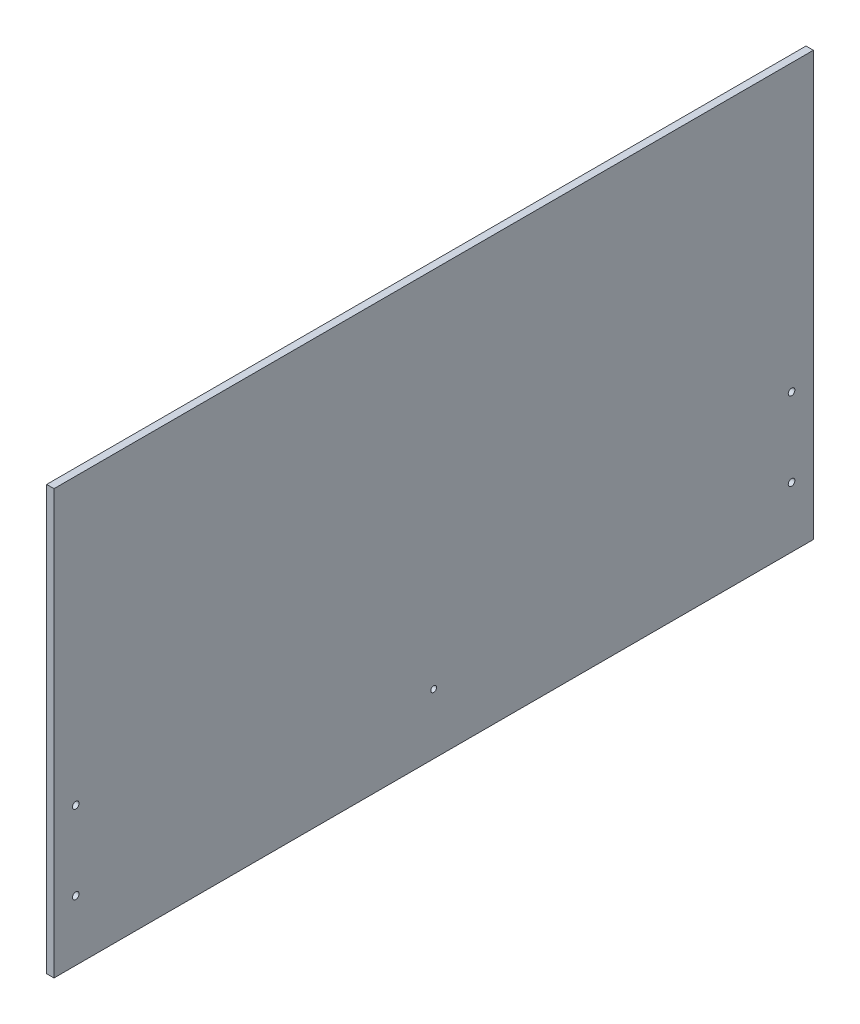
ISO-10303-21;
HEADER;
FILE_DESCRIPTION(('STEP AP214'),'2;1');
FILE_NAME('part.step','',(''),(''),'','','');
FILE_SCHEMA(('AUTOMOTIVE_DESIGN { 1 0 10303 214 1 1 1 1 }'));
ENDSEC;
DATA;
#1=APPLICATION_CONTEXT('core data for automotive mechanical design processes');
#2=APPLICATION_PROTOCOL_DEFINITION('international standard','automotive_design',2000,#1);
#3=PRODUCT_CONTEXT('',#1,'mechanical');
#4=PRODUCT('Part','Part','',(#3));
#5=PRODUCT_RELATED_PRODUCT_CATEGORY('part','',(#4));
#6=PRODUCT_DEFINITION_FORMATION('','',#4);
#7=PRODUCT_DEFINITION_CONTEXT('part definition',#1,'design');
#8=PRODUCT_DEFINITION('design','',#6,#7);
#9=PRODUCT_DEFINITION_SHAPE('','',#8);
#10=(LENGTH_UNIT() NAMED_UNIT(*) SI_UNIT(.MILLI.,.METRE.));
#11=(NAMED_UNIT(*) PLANE_ANGLE_UNIT() SI_UNIT($,.RADIAN.));
#12=(NAMED_UNIT(*) SI_UNIT($,.STERADIAN.) SOLID_ANGLE_UNIT());
#13=UNCERTAINTY_MEASURE_WITH_UNIT(LENGTH_MEASURE(1.E-05),#10,'distance_accuracy_value','');
#14=(GEOMETRIC_REPRESENTATION_CONTEXT(3) GLOBAL_UNCERTAINTY_ASSIGNED_CONTEXT((#13)) GLOBAL_UNIT_ASSIGNED_CONTEXT((#10,
#11,#12)) REPRESENTATION_CONTEXT('',''));
#15=CARTESIAN_POINT('',(0.,0.,0.));
#16=DIRECTION('',(0.,0.,1.));
#17=DIRECTION('',(1.,0.,0.));
#18=AXIS2_PLACEMENT_3D('',#15,#16,#17);
#19=CARTESIAN_POINT('',(4.7625,-137.31875,-246.0625));
#20=DIRECTION('',(0.,0.,1.));
#21=DIRECTION('',(1.,0.,0.));
#22=AXIS2_PLACEMENT_3D('',#19,#20,#21);
#23=PLANE('',#22);
#24=DIRECTION('',(0.,1.,0.));
#25=VECTOR('',#24,1.);
#26=CARTESIAN_POINT('',(0.,-137.31875,-246.0625));
#27=LINE('',#26,#25);
#28=CARTESIAN_POINT('',(0.,-137.31875,-246.0625));
#29=VERTEX_POINT('',#28);
#30=CARTESIAN_POINT('',(0.,137.31875,-246.0625));
#31=VERTEX_POINT('',#30);
#32=EDGE_CURVE('E99',#29,#31,#27,.T.);
#33=ORIENTED_EDGE('',*,*,#32,.T.);
#34=DIRECTION('',(-1.,0.,0.));
#35=VECTOR('',#34,1.);
#36=CARTESIAN_POINT('',(4.7625,137.31875,-246.0625));
#37=LINE('',#36,#35);
#38=CARTESIAN_POINT('',(4.7625,137.31875,-246.0625));
#39=VERTEX_POINT('',#38);
#40=EDGE_CURVE('E11',#39,#31,#37,.T.);
#41=ORIENTED_EDGE('',*,*,#40,.F.);
#42=DIRECTION('',(0.,1.,0.));
#43=VECTOR('',#42,1.);
#44=CARTESIAN_POINT('',(4.7625,-137.31875,-246.0625));
#45=LINE('',#44,#43);
#46=CARTESIAN_POINT('',(4.7625,-137.31875,-246.0625));
#47=VERTEX_POINT('',#46);
#48=EDGE_CURVE('E86',#47,#39,#45,.T.);
#49=ORIENTED_EDGE('',*,*,#48,.F.);
#50=DIRECTION('',(-1.,0.,0.));
#51=VECTOR('',#50,1.);
#52=CARTESIAN_POINT('',(4.7625,-137.31875,-246.0625));
#53=LINE('',#52,#51);
#54=EDGE_CURVE('E95',#47,#29,#53,.T.);
#55=ORIENTED_EDGE('',*,*,#54,.T.);
#56=EDGE_LOOP('',(#33,#41,#49,#55));
#57=FACE_BOUND('',#56,.T.);
#58=ADVANCED_FACE('F33',(#57),#23,.F.);
#59=CARTESIAN_POINT('',(4.7625,137.31875,246.0625));
#60=DIRECTION('',(0.,-1.,0.));
#61=DIRECTION('',(0.,0.,-1.));
#62=AXIS2_PLACEMENT_3D('',#59,#60,#61);
#63=PLANE('',#62);
#64=DIRECTION('',(0.,0.,1.));
#65=VECTOR('',#64,1.);
#66=CARTESIAN_POINT('',(0.,137.31875,246.0625));
#67=LINE('',#66,#65);
#68=CARTESIAN_POINT('',(0.,137.31875,246.0625));
#69=VERTEX_POINT('',#68);
#70=EDGE_CURVE('E90',#31,#69,#67,.T.);
#71=ORIENTED_EDGE('',*,*,#70,.T.);
#72=DIRECTION('',(-1.,0.,0.));
#73=VECTOR('',#72,1.);
#74=CARTESIAN_POINT('',(4.7625,137.31875,246.0625));
#75=LINE('',#74,#73);
#76=CARTESIAN_POINT('',(4.7625,137.31875,246.0625));
#77=VERTEX_POINT('',#76);
#78=EDGE_CURVE('E42',#77,#69,#75,.T.);
#79=ORIENTED_EDGE('',*,*,#78,.F.);
#80=DIRECTION('',(0.,0.,1.));
#81=VECTOR('',#80,1.);
#82=CARTESIAN_POINT('',(4.7625,137.31875,246.0625));
#83=LINE('',#82,#81);
#84=EDGE_CURVE('E81',#39,#77,#83,.T.);
#85=ORIENTED_EDGE('',*,*,#84,.F.);
#86=ORIENTED_EDGE('',*,*,#40,.T.);
#87=EDGE_LOOP('',(#71,#79,#85,#86));
#88=FACE_BOUND('',#87,.T.);
#89=ADVANCED_FACE('F89',(#88),#63,.F.);
#90=CARTESIAN_POINT('',(4.7625,-137.31875,246.0625));
#91=DIRECTION('',(0.,0.,-1.));
#92=DIRECTION('',(-1.,0.,0.));
#93=AXIS2_PLACEMENT_3D('',#90,#91,#92);
#94=PLANE('',#93);
#95=DIRECTION('',(0.,-1.,0.));
#96=VECTOR('',#95,1.);
#97=CARTESIAN_POINT('',(0.,-137.31875,246.0625));
#98=LINE('',#97,#96);
#99=CARTESIAN_POINT('',(0.,-137.31875,246.0625));
#100=VERTEX_POINT('',#99);
#101=EDGE_CURVE('E68',#69,#100,#98,.T.);
#102=ORIENTED_EDGE('',*,*,#101,.T.);
#103=DIRECTION('',(-1.,0.,0.));
#104=VECTOR('',#103,1.);
#105=CARTESIAN_POINT('',(4.7625,-137.31875,246.0625));
#106=LINE('',#105,#104);
#107=CARTESIAN_POINT('',(4.7625,-137.31875,246.0625));
#108=VERTEX_POINT('',#107);
#109=EDGE_CURVE('E91',#108,#100,#106,.T.);
#110=ORIENTED_EDGE('',*,*,#109,.F.);
#111=DIRECTION('',(0.,-1.,0.));
#112=VECTOR('',#111,1.);
#113=CARTESIAN_POINT('',(4.7625,-137.31875,246.0625));
#114=LINE('',#113,#112);
#115=EDGE_CURVE('E84',#77,#108,#114,.T.);
#116=ORIENTED_EDGE('',*,*,#115,.F.);
#117=ORIENTED_EDGE('',*,*,#78,.T.);
#118=EDGE_LOOP('',(#102,#110,#116,#117));
#119=FACE_BOUND('',#118,.T.);
#120=ADVANCED_FACE('F93',(#119),#94,.F.);
#121=CARTESIAN_POINT('',(4.7625,-137.31875,246.0625));
#122=DIRECTION('',(0.,1.,0.));
#123=DIRECTION('',(0.,0.,1.));
#124=AXIS2_PLACEMENT_3D('',#121,#122,#123);
#125=PLANE('',#124);
#126=DIRECTION('',(0.,0.,-1.));
#127=VECTOR('',#126,1.);
#128=CARTESIAN_POINT('',(0.,-137.31875,246.0625));
#129=LINE('',#128,#127);
#130=EDGE_CURVE('E74',#100,#29,#129,.T.);
#131=ORIENTED_EDGE('',*,*,#130,.T.);
#132=ORIENTED_EDGE('',*,*,#54,.F.);
#133=DIRECTION('',(0.,0.,-1.));
#134=VECTOR('',#133,1.);
#135=CARTESIAN_POINT('',(4.7625,-137.31875,246.0625));
#136=LINE('',#135,#134);
#137=EDGE_CURVE('E51',#108,#47,#136,.T.);
#138=ORIENTED_EDGE('',*,*,#137,.F.);
#139=ORIENTED_EDGE('',*,*,#109,.T.);
#140=EDGE_LOOP('',(#131,#132,#138,#139));
#141=FACE_BOUND('',#140,.T.);
#142=ADVANCED_FACE('F143',(#141),#125,.F.);
#143=CARTESIAN_POINT('',(4.7625,0.,0.));
#144=DIRECTION('',(-1.,0.,0.));
#145=DIRECTION('',(0.,0.,1.));
#146=AXIS2_PLACEMENT_3D('',#143,#144,#145);
#147=PLANE('',#146);
#148=CARTESIAN_POINT('',(4.7625,-98.20275,0.));
#149=DIRECTION('',(1.,0.,0.));
#150=DIRECTION('',(0.,0.,-1.));
#151=AXIS2_PLACEMENT_3D('',#148,#149,#150);
#152=CIRCLE('',#151,1.89865);
#153=CARTESIAN_POINT('',(4.7625,-98.20275,-1.89864999999995));
#154=VERTEX_POINT('',#153);
#155=EDGE_CURVE('E233',#154,#154,#152,.T.);
#156=ORIENTED_EDGE('',*,*,#155,.F.);
#157=EDGE_LOOP('',(#156));
#158=FACE_BOUND('',#157,.T.);
#159=CARTESIAN_POINT('',(4.7625,-98.20275,231.93375));
#160=DIRECTION('',(1.,0.,0.));
#161=DIRECTION('',(0.,0.,-1.));
#162=AXIS2_PLACEMENT_3D('',#159,#160,#161);
#163=CIRCLE('',#162,2.15264999999999);
#164=CARTESIAN_POINT('',(4.7625,-98.20275,229.7811));
#165=VERTEX_POINT('',#164);
#166=EDGE_CURVE('E121',#165,#165,#163,.T.);
#167=ORIENTED_EDGE('',*,*,#166,.F.);
#168=EDGE_LOOP('',(#167));
#169=FACE_BOUND('',#168,.T.);
#170=CARTESIAN_POINT('',(4.7625,-47.40275,231.93375));
#171=DIRECTION('',(1.,0.,0.));
#172=DIRECTION('',(0.,0.,-1.));
#173=AXIS2_PLACEMENT_3D('',#170,#171,#172);
#174=CIRCLE('',#173,2.15264999999999);
#175=CARTESIAN_POINT('',(4.7625,-47.40275,229.7811));
#176=VERTEX_POINT('',#175);
#177=EDGE_CURVE('E110',#176,#176,#174,.T.);
#178=ORIENTED_EDGE('',*,*,#177,.F.);
#179=EDGE_LOOP('',(#178));
#180=FACE_BOUND('',#179,.T.);
#181=CARTESIAN_POINT('',(4.7625,-47.40275,-231.93375));
#182=DIRECTION('',(1.,0.,0.));
#183=DIRECTION('',(0.,0.,-1.));
#184=AXIS2_PLACEMENT_3D('',#181,#182,#183);
#185=CIRCLE('',#184,2.15264999999999);
#186=CARTESIAN_POINT('',(4.7625,-47.40275,-234.0864));
#187=VERTEX_POINT('',#186);
#188=EDGE_CURVE('E109',#187,#187,#185,.T.);
#189=ORIENTED_EDGE('',*,*,#188,.F.);
#190=EDGE_LOOP('',(#189));
#191=FACE_BOUND('',#190,.T.);
#192=CARTESIAN_POINT('',(4.7625,-98.20275,-231.93375));
#193=DIRECTION('',(1.,0.,0.));
#194=DIRECTION('',(0.,0.,-1.));
#195=AXIS2_PLACEMENT_3D('',#192,#193,#194);
#196=CIRCLE('',#195,2.15264999999999);
#197=CARTESIAN_POINT('',(4.7625,-98.20275,-234.0864));
#198=VERTEX_POINT('',#197);
#199=EDGE_CURVE('E127',#198,#198,#196,.T.);
#200=ORIENTED_EDGE('',*,*,#199,.F.);
#201=EDGE_LOOP('',(#200));
#202=FACE_BOUND('',#201,.T.);
#203=ORIENTED_EDGE('',*,*,#48,.T.);
#204=ORIENTED_EDGE('',*,*,#84,.T.);
#205=ORIENTED_EDGE('',*,*,#115,.T.);
#206=ORIENTED_EDGE('',*,*,#137,.T.);
#207=EDGE_LOOP('',(#203,#204,#205,#206));
#208=FACE_BOUND('',#207,.T.);
#209=ADVANCED_FACE('F82',(#158,#169,#180,#191,#202,#208),#147,.F.);
#210=CARTESIAN_POINT('',(0.,0.,0.));
#211=DIRECTION('',(-1.,0.,0.));
#212=DIRECTION('',(0.,0.,1.));
#213=AXIS2_PLACEMENT_3D('',#210,#211,#212);
#214=PLANE('',#213);
#215=CARTESIAN_POINT('',(0.,-98.20275,0.));
#216=DIRECTION('',(-1.,0.,0.));
#217=DIRECTION('',(0.,0.,1.));
#218=AXIS2_PLACEMENT_3D('',#215,#216,#217);
#219=CIRCLE('',#218,1.89865);
#220=CARTESIAN_POINT('',(0.,-98.20275,1.89865000000006));
#221=VERTEX_POINT('',#220);
#222=EDGE_CURVE('E230',#221,#221,#219,.T.);
#223=ORIENTED_EDGE('',*,*,#222,.F.);
#224=EDGE_LOOP('',(#223));
#225=FACE_BOUND('',#224,.T.);
#226=CARTESIAN_POINT('',(0.,-98.20275,231.93375));
#227=DIRECTION('',(-1.,0.,0.));
#228=DIRECTION('',(0.,0.,1.));
#229=AXIS2_PLACEMENT_3D('',#226,#227,#228);
#230=CIRCLE('',#229,2.15264999999999);
#231=CARTESIAN_POINT('',(0.,-98.20275,234.0864));
#232=VERTEX_POINT('',#231);
#233=EDGE_CURVE('E36',#232,#232,#230,.T.);
#234=ORIENTED_EDGE('',*,*,#233,.F.);
#235=EDGE_LOOP('',(#234));
#236=FACE_BOUND('',#235,.T.);
#237=CARTESIAN_POINT('',(0.,-47.40275,231.93375));
#238=DIRECTION('',(-1.,0.,0.));
#239=DIRECTION('',(0.,0.,1.));
#240=AXIS2_PLACEMENT_3D('',#237,#238,#239);
#241=CIRCLE('',#240,2.15264999999999);
#242=CARTESIAN_POINT('',(0.,-47.40275,234.0864));
#243=VERTEX_POINT('',#242);
#244=EDGE_CURVE('E107',#243,#243,#241,.T.);
#245=ORIENTED_EDGE('',*,*,#244,.F.);
#246=EDGE_LOOP('',(#245));
#247=FACE_BOUND('',#246,.T.);
#248=CARTESIAN_POINT('',(0.,-47.40275,-231.93375));
#249=DIRECTION('',(-1.,0.,0.));
#250=DIRECTION('',(0.,0.,1.));
#251=AXIS2_PLACEMENT_3D('',#248,#249,#250);
#252=CIRCLE('',#251,2.15264999999999);
#253=CARTESIAN_POINT('',(0.,-47.40275,-229.7811));
#254=VERTEX_POINT('',#253);
#255=EDGE_CURVE('E114',#254,#254,#252,.T.);
#256=ORIENTED_EDGE('',*,*,#255,.F.);
#257=EDGE_LOOP('',(#256));
#258=FACE_BOUND('',#257,.T.);
#259=CARTESIAN_POINT('',(0.,-98.20275,-231.93375));
#260=DIRECTION('',(-1.,0.,0.));
#261=DIRECTION('',(0.,0.,1.));
#262=AXIS2_PLACEMENT_3D('',#259,#260,#261);
#263=CIRCLE('',#262,2.15264999999999);
#264=CARTESIAN_POINT('',(0.,-98.20275,-229.7811));
#265=VERTEX_POINT('',#264);
#266=EDGE_CURVE('E102',#265,#265,#263,.T.);
#267=ORIENTED_EDGE('',*,*,#266,.F.);
#268=EDGE_LOOP('',(#267));
#269=FACE_BOUND('',#268,.T.);
#270=ORIENTED_EDGE('',*,*,#32,.F.);
#271=ORIENTED_EDGE('',*,*,#130,.F.);
#272=ORIENTED_EDGE('',*,*,#101,.F.);
#273=ORIENTED_EDGE('',*,*,#70,.F.);
#274=EDGE_LOOP('',(#270,#271,#272,#273));
#275=FACE_BOUND('',#274,.T.);
#276=ADVANCED_FACE('F136',(#225,#236,#247,#258,#269,#275),#214,.T.);
#277=CARTESIAN_POINT('',(4.7625,-98.20275,-231.93375));
#278=DIRECTION('',(1.,0.,0.));
#279=DIRECTION('',(0.,0.,-1.));
#280=AXIS2_PLACEMENT_3D('',#277,#278,#279);
#281=CYLINDRICAL_SURFACE('',#280,2.15264999999999);
#282=ORIENTED_EDGE('',*,*,#266,.T.);
#283=EDGE_LOOP('',(#282));
#284=FACE_BOUND('',#283,.T.);
#285=ORIENTED_EDGE('',*,*,#199,.T.);
#286=EDGE_LOOP('',(#285));
#287=FACE_BOUND('',#286,.T.);
#288=ADVANCED_FACE('F133',(#284,#287),#281,.F.);
#289=CARTESIAN_POINT('',(4.7625,-47.40275,-231.93375));
#290=DIRECTION('',(1.,0.,0.));
#291=DIRECTION('',(0.,0.,-1.));
#292=AXIS2_PLACEMENT_3D('',#289,#290,#291);
#293=CYLINDRICAL_SURFACE('',#292,2.15264999999999);
#294=ORIENTED_EDGE('',*,*,#255,.T.);
#295=EDGE_LOOP('',(#294));
#296=FACE_BOUND('',#295,.T.);
#297=ORIENTED_EDGE('',*,*,#188,.T.);
#298=EDGE_LOOP('',(#297));
#299=FACE_BOUND('',#298,.T.);
#300=ADVANCED_FACE('F178',(#296,#299),#293,.F.);
#301=CARTESIAN_POINT('',(4.7625,-47.40275,231.93375));
#302=DIRECTION('',(1.,0.,0.));
#303=DIRECTION('',(0.,0.,-1.));
#304=AXIS2_PLACEMENT_3D('',#301,#302,#303);
#305=CYLINDRICAL_SURFACE('',#304,2.15264999999999);
#306=ORIENTED_EDGE('',*,*,#244,.T.);
#307=EDGE_LOOP('',(#306));
#308=FACE_BOUND('',#307,.T.);
#309=ORIENTED_EDGE('',*,*,#177,.T.);
#310=EDGE_LOOP('',(#309));
#311=FACE_BOUND('',#310,.T.);
#312=ADVANCED_FACE('F189',(#308,#311),#305,.F.);
#313=CARTESIAN_POINT('',(4.7625,-98.20275,231.93375));
#314=DIRECTION('',(1.,0.,0.));
#315=DIRECTION('',(0.,0.,-1.));
#316=AXIS2_PLACEMENT_3D('',#313,#314,#315);
#317=CYLINDRICAL_SURFACE('',#316,2.15264999999999);
#318=ORIENTED_EDGE('',*,*,#233,.T.);
#319=EDGE_LOOP('',(#318));
#320=FACE_BOUND('',#319,.T.);
#321=ORIENTED_EDGE('',*,*,#166,.T.);
#322=EDGE_LOOP('',(#321));
#323=FACE_BOUND('',#322,.T.);
#324=ADVANCED_FACE('F199',(#320,#323),#317,.F.);
#325=CARTESIAN_POINT('',(4.7625,-98.20275,0.));
#326=DIRECTION('',(1.,0.,0.));
#327=DIRECTION('',(0.,0.,-1.));
#328=AXIS2_PLACEMENT_3D('',#325,#326,#327);
#329=CYLINDRICAL_SURFACE('',#328,1.89865);
#330=ORIENTED_EDGE('',*,*,#222,.T.);
#331=EDGE_LOOP('',(#330));
#332=FACE_BOUND('',#331,.T.);
#333=ORIENTED_EDGE('',*,*,#155,.T.);
#334=EDGE_LOOP('',(#333));
#335=FACE_BOUND('',#334,.T.);
#336=ADVANCED_FACE('F207',(#332,#335),#329,.F.);
#337=CLOSED_SHELL('',(#58,#89,#120,#142,#209,#276,#288,#300,#312,#324,#336));
#338=MANIFOLD_SOLID_BREP('B2',#337);
#339=ADVANCED_BREP_SHAPE_REPRESENTATION('',(#18,#338),#14);
#340=SHAPE_DEFINITION_REPRESENTATION(#9,#339);
ENDSEC;
END-ISO-10303-21;
